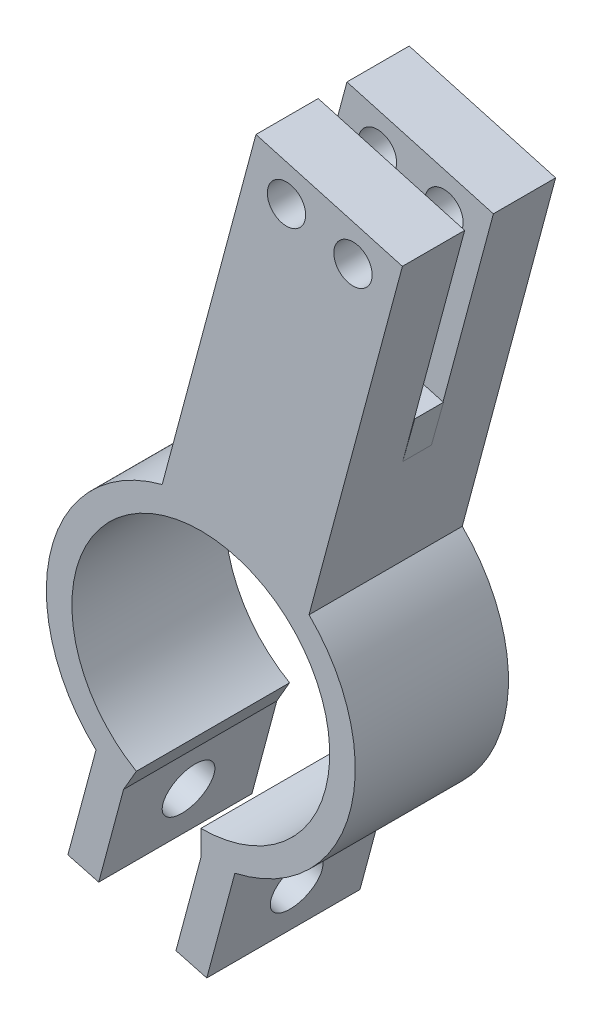
ISO-10303-21;
HEADER;
FILE_DESCRIPTION(('STEP AP214'),'2;1');
FILE_NAME('part.step','',(''),(''),'','','');
FILE_SCHEMA(('AUTOMOTIVE_DESIGN { 1 0 10303 214 1 1 1 1 }'));
ENDSEC;
DATA;
#1=APPLICATION_CONTEXT('core data for automotive mechanical design processes');
#2=APPLICATION_PROTOCOL_DEFINITION('international standard','automotive_design',2000,#1);
#3=PRODUCT_CONTEXT('',#1,'mechanical');
#4=PRODUCT('Part','Part','',(#3));
#5=PRODUCT_RELATED_PRODUCT_CATEGORY('part','',(#4));
#6=PRODUCT_DEFINITION_FORMATION('','',#4);
#7=PRODUCT_DEFINITION_CONTEXT('part definition',#1,'design');
#8=PRODUCT_DEFINITION('design','',#6,#7);
#9=PRODUCT_DEFINITION_SHAPE('','',#8);
#10=(LENGTH_UNIT() NAMED_UNIT(*) SI_UNIT(.MILLI.,.METRE.));
#11=(NAMED_UNIT(*) PLANE_ANGLE_UNIT() SI_UNIT($,.RADIAN.));
#12=(NAMED_UNIT(*) SI_UNIT($,.STERADIAN.) SOLID_ANGLE_UNIT());
#13=UNCERTAINTY_MEASURE_WITH_UNIT(LENGTH_MEASURE(1.E-05),#10,'distance_accuracy_value','');
#14=(GEOMETRIC_REPRESENTATION_CONTEXT(3) GLOBAL_UNCERTAINTY_ASSIGNED_CONTEXT((#13)) GLOBAL_UNIT_ASSIGNED_CONTEXT((#10,
#11,#12)) REPRESENTATION_CONTEXT('',''));
#15=CARTESIAN_POINT('',(0.,0.,0.));
#16=DIRECTION('',(0.,0.,1.));
#17=DIRECTION('',(1.,0.,0.));
#18=AXIS2_PLACEMENT_3D('',#15,#16,#17);
#19=CARTESIAN_POINT('',(-11.5029221421502,3.08219869858711,0.));
#20=DIRECTION('',(-0.965925826289068,0.25881904510252,0.));
#21=DIRECTION('',(-0.25881904510252,-0.965925826289069,0.));
#22=AXIS2_PLACEMENT_3D('',#19,#20,#21);
#23=PLANE('',#22);
#24=DIRECTION('',(-0.25881904510252,-0.965925826289069,0.));
#25=VECTOR('',#24,1.);
#26=CARTESIAN_POINT('',(-11.5029221421502,3.08219869858711,9.74999999999994));
#27=LINE('',#26,#25);
#28=CARTESIAN_POINT('',(-0.936311500436195,42.5173264772618,9.74999999999994));
#29=VERTEX_POINT('',#28);
#30=CARTESIAN_POINT('',(-1.19514591359743,41.5513432965967,9.74999999999994));
#31=VERTEX_POINT('',#30);
#32=EDGE_CURVE('E237',#29,#31,#27,.T.);
#33=ORIENTED_EDGE('',*,*,#32,.F.);
#34=DIRECTION('',(0.25881904510252,0.965925826289069,0.));
#35=VECTOR('',#34,1.);
#36=CARTESIAN_POINT('',(-11.5029221421502,3.08219869858711,9.74999999999994));
#37=LINE('',#36,#35);
#38=CARTESIAN_POINT('',(8.6405617865299,78.2587041618684,9.74999999999994));
#39=VERTEX_POINT('',#38);
#40=EDGE_CURVE('E268',#29,#39,#37,.T.);
#41=ORIENTED_EDGE('',*,*,#40,.T.);
#42=DIRECTION('',(0.,0.,1.));
#43=VECTOR('',#42,1.);
#44=CARTESIAN_POINT('',(8.64056178652989,78.2587041618684,-1.2490009027033E-13));
#45=LINE('',#44,#43);
#46=CARTESIAN_POINT('',(8.64056178652989,78.2587041618684,-1.2490009027033E-13));
#47=VERTEX_POINT('',#46);
#48=EDGE_CURVE('E308',#47,#39,#45,.T.);
#49=ORIENTED_EDGE('',*,*,#48,.F.);
#50=DIRECTION('',(-0.25881904510252,-0.965925826289069,0.));
#51=VECTOR('',#50,1.);
#52=CARTESIAN_POINT('',(-11.5029221421502,3.08219869858711,0.));
#53=LINE('',#52,#51);
#54=CARTESIAN_POINT('',(-6.05243588567322,23.4236903337157,-3.19189119579733E-13));
#55=VERTEX_POINT('',#54);
#56=EDGE_CURVE('E285',#47,#55,#53,.T.);
#57=ORIENTED_EDGE('',*,*,#56,.T.);
#58=DIRECTION('',(0.,0.,1.));
#59=VECTOR('',#58,1.);
#60=CARTESIAN_POINT('',(-6.05243588567322,23.4236903337157,-3.19189119579733E-13));
#61=LINE('',#60,#59);
#62=CARTESIAN_POINT('',(-6.05243588567299,23.4236903337159,24.));
#63=VERTEX_POINT('',#62);
#64=EDGE_CURVE('E305',#55,#63,#61,.T.);
#65=ORIENTED_EDGE('',*,*,#64,.T.);
#66=DIRECTION('',(-0.25881904510252,-0.965925826289069,0.));
#67=VECTOR('',#66,1.);
#68=CARTESIAN_POINT('',(-11.5029221421502,3.08219869858711,23.9999999999999));
#69=LINE('',#68,#67);
#70=CARTESIAN_POINT('',(8.64056178652989,78.2587041618684,23.9999999999999));
#71=VERTEX_POINT('',#70);
#72=EDGE_CURVE('E276',#71,#63,#69,.T.);
#73=ORIENTED_EDGE('',*,*,#72,.F.);
#74=CARTESIAN_POINT('',(8.64056178652989,78.2587041618684,14.2499999999999));
#75=VERTEX_POINT('',#74);
#76=EDGE_CURVE('E311',#75,#71,#45,.T.);
#77=ORIENTED_EDGE('',*,*,#76,.F.);
#78=DIRECTION('',(0.25881904510252,0.965925826289069,0.));
#79=VECTOR('',#78,1.);
#80=CARTESIAN_POINT('',(-11.5029221421502,3.08219869858711,14.2499999999999));
#81=LINE('',#80,#79);
#82=CARTESIAN_POINT('',(-0.936311500436195,42.5173264772618,14.2499999999999));
#83=VERTEX_POINT('',#82);
#84=EDGE_CURVE('E260',#83,#75,#81,.T.);
#85=ORIENTED_EDGE('',*,*,#84,.F.);
#86=DIRECTION('',(0.25881904510252,0.965925826289069,0.));
#87=VECTOR('',#86,1.);
#88=CARTESIAN_POINT('',(-11.5029221421502,3.08219869858711,14.2499999999999));
#89=LINE('',#88,#87);
#90=CARTESIAN_POINT('',(-1.19514591359743,41.5513432965967,14.2499999999999));
#91=VERTEX_POINT('',#90);
#92=EDGE_CURVE('E53',#91,#83,#89,.T.);
#93=ORIENTED_EDGE('',*,*,#92,.F.);
#94=DIRECTION('',(0.,0.,-1.));
#95=VECTOR('',#94,1.);
#96=CARTESIAN_POINT('',(-1.19514591359743,41.5513432965967,0.));
#97=LINE('',#96,#95);
#98=EDGE_CURVE('E11',#91,#31,#97,.T.);
#99=ORIENTED_EDGE('',*,*,#98,.T.);
#100=EDGE_LOOP('',(#33,#41,#49,#57,#65,#73,#77,#85,#93,#99));
#101=FACE_BOUND('',#100,.T.);
#102=ADVANCED_FACE('F35',(#101),#23,.T.);
#103=CARTESIAN_POINT('',(23.8358681079456,68.2980987617466,0.));
#104=DIRECTION('',(0.,0.,1.));
#105=DIRECTION('',(1.,0.,0.));
#106=AXIS2_PLACEMENT_3D('',#103,#104,#105);
#107=CYLINDRICAL_SURFACE('',#106,2.99999999999954);
#108=CARTESIAN_POINT('',(23.8358681079456,68.2980987617466,0.));
#109=DIRECTION('',(0.,0.,1.));
#110=DIRECTION('',(1.,0.,0.));
#111=AXIS2_PLACEMENT_3D('',#108,#109,#110);
#112=CIRCLE('',#111,2.99999999999954);
#113=CARTESIAN_POINT('',(26.8358681079451,68.2980987617466,0.));
#114=VERTEX_POINT('',#113);
#115=EDGE_CURVE('E275',#114,#114,#112,.T.);
#116=ORIENTED_EDGE('',*,*,#115,.F.);
#117=EDGE_LOOP('',(#116));
#118=FACE_BOUND('',#117,.T.);
#119=CARTESIAN_POINT('',(23.8358681079456,68.2980987617466,9.74999999999994));
#120=DIRECTION('',(0.,0.,1.));
#121=DIRECTION('',(1.,0.,0.));
#122=AXIS2_PLACEMENT_3D('',#119,#120,#121);
#123=CIRCLE('',#122,2.99999999999954);
#124=CARTESIAN_POINT('',(26.8358681079451,68.2980987617466,9.74999999999994));
#125=VERTEX_POINT('',#124);
#126=EDGE_CURVE('E265',#125,#125,#123,.F.);
#127=ORIENTED_EDGE('',*,*,#126,.F.);
#128=EDGE_LOOP('',(#127));
#129=FACE_BOUND('',#128,.T.);
#130=ADVANCED_FACE('F493',(#118,#129),#107,.F.);
#131=CARTESIAN_POINT('',(13.421299192768,71.2106731786557,-1.2490009027033E-13));
#132=DIRECTION('',(0.,0.,1.));
#133=DIRECTION('',(1.,0.,0.));
#134=AXIS2_PLACEMENT_3D('',#131,#132,#133);
#135=CYLINDRICAL_SURFACE('',#134,3.0000000000001);
#136=CARTESIAN_POINT('',(13.421299192768,71.2106731786557,-1.2490009027033E-13));
#137=DIRECTION('',(0.,0.,1.));
#138=DIRECTION('',(1.,0.,0.));
#139=AXIS2_PLACEMENT_3D('',#136,#137,#138);
#140=CIRCLE('',#139,3.0000000000001);
#141=CARTESIAN_POINT('',(16.4212991927682,71.2106731786557,-1.24882686260833E-13));
#142=VERTEX_POINT('',#141);
#143=EDGE_CURVE('E272',#142,#142,#140,.T.);
#144=ORIENTED_EDGE('',*,*,#143,.F.);
#145=EDGE_LOOP('',(#144));
#146=FACE_BOUND('',#145,.T.);
#147=CARTESIAN_POINT('',(13.421299192768,71.2106731786557,9.74999999999994));
#148=DIRECTION('',(0.,0.,1.));
#149=DIRECTION('',(1.,0.,0.));
#150=AXIS2_PLACEMENT_3D('',#147,#148,#149);
#151=CIRCLE('',#150,3.0000000000001);
#152=CARTESIAN_POINT('',(16.4212991927682,71.2106731786557,9.74999999999994));
#153=VERTEX_POINT('',#152);
#154=EDGE_CURVE('E262',#153,#153,#151,.F.);
#155=ORIENTED_EDGE('',*,*,#154,.F.);
#156=EDGE_LOOP('',(#155));
#157=FACE_BOUND('',#156,.T.);
#158=ADVANCED_FACE('F495',(#146,#157),#135,.F.);
#159=CARTESIAN_POINT('',(20.92529127906,74.8231141600154,0.));
#160=DIRECTION('',(0.269329374048198,0.963048123550846,0.));
#161=DIRECTION('',(-0.963048123550846,0.269329374048198,0.));
#162=AXIS2_PLACEMENT_3D('',#159,#160,#161);
#163=PLANE('',#162);
#164=ORIENTED_EDGE('',*,*,#48,.T.);
#165=DIRECTION('',(0.963048123550846,-0.269329374048198,0.));
#166=VECTOR('',#165,1.);
#167=CARTESIAN_POINT('',(20.9252912790602,74.8231141600154,9.74999999999994));
#168=LINE('',#167,#166);
#169=CARTESIAN_POINT('',(31.5792286287139,71.8435971375937,9.74999999999994));
#170=VERTEX_POINT('',#169);
#171=EDGE_CURVE('E251',#39,#170,#168,.T.);
#172=ORIENTED_EDGE('',*,*,#171,.T.);
#173=DIRECTION('',(0.,0.,1.));
#174=VECTOR('',#173,1.);
#175=CARTESIAN_POINT('',(31.5792286287138,71.8435971375937,0.));
#176=LINE('',#175,#174);
#177=CARTESIAN_POINT('',(31.5792286287138,71.8435971375937,0.));
#178=VERTEX_POINT('',#177);
#179=EDGE_CURVE('E312',#178,#170,#176,.T.);
#180=ORIENTED_EDGE('',*,*,#179,.F.);
#181=DIRECTION('',(-0.963048123550847,0.269329374048198,0.));
#182=VECTOR('',#181,1.);
#183=CARTESIAN_POINT('',(20.92529127906,74.8231141600154,0.));
#184=LINE('',#183,#182);
#185=EDGE_CURVE('E282',#178,#47,#184,.T.);
#186=ORIENTED_EDGE('',*,*,#185,.T.);
#187=EDGE_LOOP('',(#164,#172,#180,#186));
#188=FACE_BOUND('',#187,.T.);
#189=ADVANCED_FACE('F457',(#188),#163,.T.);
#190=CARTESIAN_POINT('',(0.,0.,24.));
#191=DIRECTION('',(0.,0.,-1.));
#192=DIRECTION('',(-1.,0.,0.));
#193=AXIS2_PLACEMENT_3D('',#190,#191,#192);
#194=CYLINDRICAL_SURFACE('',#193,24.193);
#195=CARTESIAN_POINT('',(0.,0.,0.));
#196=DIRECTION('',(0.,0.,1.));
#197=DIRECTION('',(1.,0.,0.));
#198=AXIS2_PLACEMENT_3D('',#195,#196,#197);
#199=CIRCLE('',#198,24.193);
#200=CARTESIAN_POINT('',(5.3360235923067,-23.5972053689064,0.));
#201=VERTEX_POINT('',#200);
#202=CARTESIAN_POINT('',(16.9534083986272,17.2592929365417,0.));
#203=VERTEX_POINT('',#202);
#204=EDGE_CURVE('E395',#201,#203,#199,.T.);
#205=ORIENTED_EDGE('',*,*,#204,.T.);
#206=DIRECTION('',(0.,0.,1.));
#207=VECTOR('',#206,1.);
#208=CARTESIAN_POINT('',(16.953408398627,17.2592929365415,0.));
#209=LINE('',#208,#207);
#210=CARTESIAN_POINT('',(16.9534083986272,17.2592929365417,24.));
#211=VERTEX_POINT('',#210);
#212=EDGE_CURVE('E302',#203,#211,#209,.T.);
#213=ORIENTED_EDGE('',*,*,#212,.T.);
#214=CARTESIAN_POINT('',(0.,0.,24.));
#215=DIRECTION('',(0.,0.,1.));
#216=DIRECTION('',(1.,0.,0.));
#217=AXIS2_PLACEMENT_3D('',#214,#215,#216);
#218=CIRCLE('',#217,24.193);
#219=CARTESIAN_POINT('',(5.3360235923067,-23.5972053689064,24.));
#220=VERTEX_POINT('',#219);
#221=EDGE_CURVE('E390',#220,#211,#218,.T.);
#222=ORIENTED_EDGE('',*,*,#221,.F.);
#223=DIRECTION('',(0.,0.,1.));
#224=VECTOR('',#223,1.);
#225=CARTESIAN_POINT('',(5.3360235923067,-23.5972053689064,0.));
#226=LINE('',#225,#224);
#227=EDGE_CURVE('E337',#201,#220,#226,.T.);
#228=ORIENTED_EDGE('',*,*,#227,.F.);
#229=EDGE_LOOP('',(#205,#213,#222,#228));
#230=FACE_BOUND('',#229,.T.);
#231=ADVANCED_FACE('F449',(#230),#194,.T.);
#232=CARTESIAN_POINT('',(-16.419734670584,-17.7677675116381,24.));
#233=VERTEX_POINT('',#232);
#234=EDGE_CURVE('E394',#63,#233,#218,.T.);
#235=ORIENTED_EDGE('',*,*,#234,.F.);
#236=ORIENTED_EDGE('',*,*,#64,.F.);
#237=CARTESIAN_POINT('',(-16.419734670584,-17.7677675116381,0.));
#238=VERTEX_POINT('',#237);
#239=EDGE_CURVE('E387',#55,#238,#199,.T.);
#240=ORIENTED_EDGE('',*,*,#239,.T.);
#241=DIRECTION('',(0.,0.,1.));
#242=VECTOR('',#241,1.);
#243=CARTESIAN_POINT('',(-16.419734670584,-17.7677675116381,0.));
#244=LINE('',#243,#242);
#245=EDGE_CURVE('E359',#238,#233,#244,.T.);
#246=ORIENTED_EDGE('',*,*,#245,.T.);
#247=EDGE_LOOP('',(#235,#236,#240,#246));
#248=FACE_BOUND('',#247,.T.);
#249=ADVANCED_FACE('F37',(#248),#194,.T.);
#250=CARTESIAN_POINT('',(0.,0.,24.));
#251=DIRECTION('',(0.,0.,1.));
#252=DIRECTION('',(1.,0.,0.));
#253=AXIS2_PLACEMENT_3D('',#250,#251,#252);
#254=PLANE('',#253);
#255=DIRECTION('',(-0.500000000000001,-0.866025403784438,0.));
#256=VECTOR('',#255,1.);
#257=CARTESIAN_POINT('',(-12.0965,-20.9517525937569,24.));
#258=LINE('',#257,#256);
#259=CARTESIAN_POINT('',(-10.0965,-17.4876509786192,24.));
#260=VERTEX_POINT('',#259);
#261=CARTESIAN_POINT('',(-12.0965,-20.9517525937569,24.));
#262=VERTEX_POINT('',#261);
#263=EDGE_CURVE('E372',#260,#262,#258,.T.);
#264=ORIENTED_EDGE('',*,*,#263,.F.);
#265=CARTESIAN_POINT('',(0.,0.,24.));
#266=DIRECTION('',(0.,0.,1.));
#267=DIRECTION('',(1.,0.,0.));
#268=AXIS2_PLACEMENT_3D('',#265,#266,#267);
#269=CIRCLE('',#268,20.193);
#270=CARTESIAN_POINT('',(0.,-20.193,24.));
#271=VERTEX_POINT('',#270);
#272=EDGE_CURVE('E384',#271,#260,#269,.T.);
#273=ORIENTED_EDGE('',*,*,#272,.F.);
#274=DIRECTION('',(0.,1.,0.));
#275=VECTOR('',#274,1.);
#276=CARTESIAN_POINT('',(0.,-24.193,24.));
#277=LINE('',#276,#275);
#278=CARTESIAN_POINT('',(0.,-24.193,24.));
#279=VERTEX_POINT('',#278);
#280=EDGE_CURVE('E362',#279,#271,#277,.T.);
#281=ORIENTED_EDGE('',*,*,#280,.F.);
#282=DIRECTION('',(0.258819045102521,0.965925826289068,0.));
#283=VECTOR('',#282,1.);
#284=CARTESIAN_POINT('',(6.04825000000001,-1.62062370312154,24.));
#285=LINE('',#284,#283);
#286=CARTESIAN_POINT('',(-3.89352930588146,-38.723849190308,24.));
#287=VERTEX_POINT('',#286);
#288=EDGE_CURVE('E324',#287,#279,#285,.T.);
#289=ORIENTED_EDGE('',*,*,#288,.F.);
#290=DIRECTION('',(-0.965925826289068,0.258819045102521,0.));
#291=VECTOR('',#290,1.);
#292=CARTESIAN_POINT('',(-9.94177930588146,-37.1032254871864,24.));
#293=LINE('',#292,#291);
#294=CARTESIAN_POINT('',(0.93609982556388,-40.0179444158206,24.));
#295=VERTEX_POINT('',#294);
#296=EDGE_CURVE('E334',#295,#287,#293,.T.);
#297=ORIENTED_EDGE('',*,*,#296,.F.);
#298=DIRECTION('',(-0.258819045102521,-0.965925826289068,0.));
#299=VECTOR('',#298,1.);
#300=CARTESIAN_POINT('',(10.8778791314454,-2.91471892863415,24.));
#301=LINE('',#300,#299);
#302=EDGE_CURVE('E328',#220,#295,#301,.T.);
#303=ORIENTED_EDGE('',*,*,#302,.F.);
#304=ORIENTED_EDGE('',*,*,#221,.T.);
#305=DIRECTION('',(0.258819045102521,0.965925826289069,0.));
#306=VECTOR('',#305,1.);
#307=CARTESIAN_POINT('',(11.50292214215,-3.08219869858731,24.));
#308=LINE('',#307,#306);
#309=CARTESIAN_POINT('',(31.5792286287138,71.8435971375937,24.));
#310=VERTEX_POINT('',#309);
#311=EDGE_CURVE('E294',#211,#310,#308,.T.);
#312=ORIENTED_EDGE('',*,*,#311,.T.);
#313=DIRECTION('',(-0.963048123550847,0.269329374048198,0.));
#314=VECTOR('',#313,1.);
#315=CARTESIAN_POINT('',(20.92529127906,74.8231141600154,24.));
#316=LINE('',#315,#314);
#317=EDGE_CURVE('E297',#310,#71,#316,.T.);
#318=ORIENTED_EDGE('',*,*,#317,.T.);
#319=ORIENTED_EDGE('',*,*,#72,.T.);
#320=ORIENTED_EDGE('',*,*,#234,.T.);
#321=DIRECTION('',(0.258819045102521,0.965925826289068,0.));
#322=VECTOR('',#321,1.);
#323=CARTESIAN_POINT('',(-10.8778791314454,2.91471892863415,24.));
#324=LINE('',#323,#322);
#325=CARTESIAN_POINT('',(-20.8196584373268,-34.1885065585523,24.));
#326=VERTEX_POINT('',#325);
#327=EDGE_CURVE('E339',#326,#233,#324,.T.);
#328=ORIENTED_EDGE('',*,*,#327,.F.);
#329=DIRECTION('',(-0.965925826289068,0.258819045102521,0.));
#330=VECTOR('',#329,1.);
#331=CARTESIAN_POINT('',(-9.94177930588146,-37.1032254871864,24.));
#332=LINE('',#331,#330);
#333=CARTESIAN_POINT('',(-15.9900293058815,-35.4826017840649,24.));
#334=VERTEX_POINT('',#333);
#335=EDGE_CURVE('E356',#334,#326,#332,.T.);
#336=ORIENTED_EDGE('',*,*,#335,.F.);
#337=DIRECTION('',(-0.258819045102521,-0.965925826289068,0.));
#338=VECTOR('',#337,1.);
#339=CARTESIAN_POINT('',(-6.04825000000001,1.62062370312154,24.));
#340=LINE('',#339,#338);
#341=EDGE_CURVE('E349',#262,#334,#340,.T.);
#342=ORIENTED_EDGE('',*,*,#341,.F.);
#343=EDGE_LOOP('',(#264,#273,#281,#289,#297,#303,#304,#312,#318,#319,#320,#328,#336,#342));
#344=FACE_BOUND('',#343,.T.);
#345=CARTESIAN_POINT('',(13.421299192768,71.2106731786557,23.9999999999999));
#346=DIRECTION('',(0.,0.,1.));
#347=DIRECTION('',(1.,0.,0.));
#348=AXIS2_PLACEMENT_3D('',#345,#346,#347);
#349=CIRCLE('',#348,3.0000000000001);
#350=CARTESIAN_POINT('',(16.4212991927682,71.2106731786557,23.9999999999999));
#351=VERTEX_POINT('',#350);
#352=EDGE_CURVE('E271',#351,#351,#349,.T.);
#353=ORIENTED_EDGE('',*,*,#352,.F.);
#354=EDGE_LOOP('',(#353));
#355=FACE_BOUND('',#354,.T.);
#356=CARTESIAN_POINT('',(23.8358681079456,68.2980987617466,24.));
#357=DIRECTION('',(0.,0.,1.));
#358=DIRECTION('',(1.,0.,0.));
#359=AXIS2_PLACEMENT_3D('',#356,#357,#358);
#360=CIRCLE('',#359,2.99999999999954);
#361=CARTESIAN_POINT('',(26.8358681079451,68.2980987617466,24.));
#362=VERTEX_POINT('',#361);
#363=EDGE_CURVE('E291',#362,#362,#360,.T.);
#364=ORIENTED_EDGE('',*,*,#363,.F.);
#365=EDGE_LOOP('',(#364));
#366=FACE_BOUND('',#365,.T.);
#367=ADVANCED_FACE('F430',(#344,#355,#366),#254,.T.);
#368=CARTESIAN_POINT('',(0.,0.,0.));
#369=DIRECTION('',(0.,0.,1.));
#370=DIRECTION('',(1.,0.,0.));
#371=AXIS2_PLACEMENT_3D('',#368,#369,#370);
#372=PLANE('',#371);
#373=CARTESIAN_POINT('',(0.,0.,0.));
#374=DIRECTION('',(0.,0.,1.));
#375=DIRECTION('',(1.,0.,0.));
#376=AXIS2_PLACEMENT_3D('',#373,#374,#375);
#377=CIRCLE('',#376,20.193);
#378=CARTESIAN_POINT('',(0.,-20.193,0.));
#379=VERTEX_POINT('',#378);
#380=CARTESIAN_POINT('',(-10.0965,-17.4876509786192,0.));
#381=VERTEX_POINT('',#380);
#382=EDGE_CURVE('E381',#379,#381,#377,.T.);
#383=ORIENTED_EDGE('',*,*,#382,.T.);
#384=DIRECTION('',(-0.500000000000001,-0.866025403784438,0.));
#385=VECTOR('',#384,1.);
#386=CARTESIAN_POINT('',(-12.0965,-20.9517525937569,0.));
#387=LINE('',#386,#385);
#388=CARTESIAN_POINT('',(-12.0965,-20.9517525937569,0.));
#389=VERTEX_POINT('',#388);
#390=EDGE_CURVE('E371',#381,#389,#387,.T.);
#391=ORIENTED_EDGE('',*,*,#390,.T.);
#392=DIRECTION('',(-0.258819045102521,-0.965925826289068,0.));
#393=VECTOR('',#392,1.);
#394=CARTESIAN_POINT('',(-6.04825000000001,1.62062370312154,0.));
#395=LINE('',#394,#393);
#396=CARTESIAN_POINT('',(-15.9900293058815,-35.4826017840649,0.));
#397=VERTEX_POINT('',#396);
#398=EDGE_CURVE('E351',#389,#397,#395,.T.);
#399=ORIENTED_EDGE('',*,*,#398,.T.);
#400=DIRECTION('',(-0.965925826289068,0.258819045102521,0.));
#401=VECTOR('',#400,1.);
#402=CARTESIAN_POINT('',(-9.94177930588146,-37.1032254871864,0.));
#403=LINE('',#402,#401);
#404=CARTESIAN_POINT('',(-20.8196584373268,-34.1885065585523,0.));
#405=VERTEX_POINT('',#404);
#406=EDGE_CURVE('E348',#397,#405,#403,.T.);
#407=ORIENTED_EDGE('',*,*,#406,.T.);
#408=DIRECTION('',(0.258819045102521,0.965925826289068,0.));
#409=VECTOR('',#408,1.);
#410=CARTESIAN_POINT('',(-10.8778791314454,2.91471892863415,0.));
#411=LINE('',#410,#409);
#412=EDGE_CURVE('E345',#405,#238,#411,.T.);
#413=ORIENTED_EDGE('',*,*,#412,.T.);
#414=ORIENTED_EDGE('',*,*,#239,.F.);
#415=ORIENTED_EDGE('',*,*,#56,.F.);
#416=ORIENTED_EDGE('',*,*,#185,.F.);
#417=DIRECTION('',(0.258819045102521,0.965925826289069,0.));
#418=VECTOR('',#417,1.);
#419=CARTESIAN_POINT('',(11.50292214215,-3.08219869858731,0.));
#420=LINE('',#419,#418);
#421=EDGE_CURVE('E279',#203,#178,#420,.T.);
#422=ORIENTED_EDGE('',*,*,#421,.F.);
#423=ORIENTED_EDGE('',*,*,#204,.F.);
#424=DIRECTION('',(-0.258819045102521,-0.965925826289068,0.));
#425=VECTOR('',#424,1.);
#426=CARTESIAN_POINT('',(10.8778791314454,-2.91471892863415,0.));
#427=LINE('',#426,#425);
#428=CARTESIAN_POINT('',(0.93609982556388,-40.0179444158206,0.));
#429=VERTEX_POINT('',#428);
#430=EDGE_CURVE('E330',#201,#429,#427,.T.);
#431=ORIENTED_EDGE('',*,*,#430,.T.);
#432=DIRECTION('',(-0.965925826289068,0.258819045102521,0.));
#433=VECTOR('',#432,1.);
#434=CARTESIAN_POINT('',(-9.94177930588146,-37.1032254871864,0.));
#435=LINE('',#434,#433);
#436=CARTESIAN_POINT('',(-3.89352930588146,-38.723849190308,0.));
#437=VERTEX_POINT('',#436);
#438=EDGE_CURVE('E327',#429,#437,#435,.T.);
#439=ORIENTED_EDGE('',*,*,#438,.T.);
#440=DIRECTION('',(0.258819045102521,0.965925826289068,0.));
#441=VECTOR('',#440,1.);
#442=CARTESIAN_POINT('',(6.04825000000001,-1.62062370312154,0.));
#443=LINE('',#442,#441);
#444=CARTESIAN_POINT('',(0.,-24.193,0.));
#445=VERTEX_POINT('',#444);
#446=EDGE_CURVE('E325',#437,#445,#443,.T.);
#447=ORIENTED_EDGE('',*,*,#446,.T.);
#448=DIRECTION('',(0.,1.,0.));
#449=VECTOR('',#448,1.);
#450=CARTESIAN_POINT('',(0.,-24.193,0.));
#451=LINE('',#450,#449);
#452=EDGE_CURVE('E368',#445,#379,#451,.T.);
#453=ORIENTED_EDGE('',*,*,#452,.T.);
#454=EDGE_LOOP('',(#383,#391,#399,#407,#413,#414,#415,#416,#422,#423,#431,#439,#447,#453));
#455=FACE_BOUND('',#454,.T.);
#456=ORIENTED_EDGE('',*,*,#143,.T.);
#457=EDGE_LOOP('',(#456));
#458=FACE_BOUND('',#457,.T.);
#459=ORIENTED_EDGE('',*,*,#115,.T.);
#460=EDGE_LOOP('',(#459));
#461=FACE_BOUND('',#460,.T.);
#462=ADVANCED_FACE('F438',(#455,#458,#461),#372,.F.);
#463=CARTESIAN_POINT('',(0.,0.,24.));
#464=DIRECTION('',(0.,0.,-1.));
#465=DIRECTION('',(-1.,0.,0.));
#466=AXIS2_PLACEMENT_3D('',#463,#464,#465);
#467=CYLINDRICAL_SURFACE('',#466,20.193);
#468=DIRECTION('',(0.,0.,-1.));
#469=VECTOR('',#468,1.);
#470=CARTESIAN_POINT('',(-10.0965,-17.4876509786192,24.));
#471=LINE('',#470,#469);
#472=EDGE_CURVE('E43',#381,#260,#471,.F.);
#473=ORIENTED_EDGE('',*,*,#472,.F.);
#474=ORIENTED_EDGE('',*,*,#382,.F.);
#475=DIRECTION('',(0.,0.,-1.));
#476=VECTOR('',#475,1.);
#477=CARTESIAN_POINT('',(0.,-20.193,24.));
#478=LINE('',#477,#476);
#479=EDGE_CURVE('E393',#271,#379,#478,.T.);
#480=ORIENTED_EDGE('',*,*,#479,.F.);
#481=ORIENTED_EDGE('',*,*,#272,.T.);
#482=EDGE_LOOP('',(#473,#474,#480,#481));
#483=FACE_BOUND('',#482,.T.);
#484=ADVANCED_FACE('F435',(#483),#467,.F.);
#485=CARTESIAN_POINT('',(0.,-24.193,0.));
#486=DIRECTION('',(1.,0.,0.));
#487=DIRECTION('',(0.,0.,-1.));
#488=AXIS2_PLACEMENT_3D('',#485,#486,#487);
#489=PLANE('',#488);
#490=ORIENTED_EDGE('',*,*,#479,.T.);
#491=ORIENTED_EDGE('',*,*,#452,.F.);
#492=DIRECTION('',(0.,0.,1.));
#493=VECTOR('',#492,1.);
#494=CARTESIAN_POINT('',(0.,-24.193,0.));
#495=LINE('',#494,#493);
#496=EDGE_CURVE('E375',#445,#279,#495,.T.);
#497=ORIENTED_EDGE('',*,*,#496,.T.);
#498=ORIENTED_EDGE('',*,*,#280,.T.);
#499=EDGE_LOOP('',(#490,#491,#497,#498));
#500=FACE_BOUND('',#499,.T.);
#501=ADVANCED_FACE('F426',(#500),#489,.F.);
#502=CARTESIAN_POINT('',(-12.0965,-20.9517525937569,0.));
#503=DIRECTION('',(-0.866025403784438,0.500000000000001,0.));
#504=DIRECTION('',(-0.500000000000001,-0.866025403784438,0.));
#505=AXIS2_PLACEMENT_3D('',#502,#503,#504);
#506=PLANE('',#505);
#507=ORIENTED_EDGE('',*,*,#472,.T.);
#508=ORIENTED_EDGE('',*,*,#263,.T.);
#509=DIRECTION('',(0.,0.,1.));
#510=VECTOR('',#509,1.);
#511=CARTESIAN_POINT('',(-12.0965,-20.9517525937569,0.));
#512=LINE('',#511,#510);
#513=EDGE_CURVE('E378',#389,#262,#512,.T.);
#514=ORIENTED_EDGE('',*,*,#513,.F.);
#515=ORIENTED_EDGE('',*,*,#390,.F.);
#516=EDGE_LOOP('',(#507,#508,#514,#515));
#517=FACE_BOUND('',#516,.T.);
#518=ADVANCED_FACE('F534',(#517),#506,.F.);
#519=CARTESIAN_POINT('',(-10.8778791314454,2.91471892863415,0.));
#520=DIRECTION('',(0.965925826289068,-0.258819045102521,0.));
#521=DIRECTION('',(0.258819045102521,0.965925826289068,0.));
#522=AXIS2_PLACEMENT_3D('',#519,#520,#521);
#523=PLANE('',#522);
#524=CARTESIAN_POINT('',(-18.7491060765067,-26.4610999482397,12.));
#525=DIRECTION('',(-0.965925826289068,0.258819045102521,0.));
#526=DIRECTION('',(-0.258819045102521,-0.965925826289068,0.));
#527=AXIS2_PLACEMENT_3D('',#524,#525,#526);
#528=CIRCLE('',#527,4.);
#529=CARTESIAN_POINT('',(-19.7843822569167,-30.324803253396,12.));
#530=VERTEX_POINT('',#529);
#531=EDGE_CURVE('E304',#530,#530,#528,.T.);
#532=ORIENTED_EDGE('',*,*,#531,.F.);
#533=EDGE_LOOP('',(#532));
#534=FACE_BOUND('',#533,.T.);
#535=ORIENTED_EDGE('',*,*,#327,.T.);
#536=ORIENTED_EDGE('',*,*,#245,.F.);
#537=ORIENTED_EDGE('',*,*,#412,.F.);
#538=DIRECTION('',(0.,0.,1.));
#539=VECTOR('',#538,1.);
#540=CARTESIAN_POINT('',(-20.8196584373268,-34.1885065585523,0.));
#541=LINE('',#540,#539);
#542=EDGE_CURVE('E353',#405,#326,#541,.T.);
#543=ORIENTED_EDGE('',*,*,#542,.T.);
#544=EDGE_LOOP('',(#535,#536,#537,#543));
#545=FACE_BOUND('',#544,.T.);
#546=ADVANCED_FACE('F537',(#534,#545),#523,.F.);
#547=CARTESIAN_POINT('',(-6.04825000000001,1.62062370312154,0.));
#548=DIRECTION('',(-0.965925826289068,0.258819045102521,0.));
#549=DIRECTION('',(-0.258819045102521,-0.965925826289068,0.));
#550=AXIS2_PLACEMENT_3D('',#547,#548,#549);
#551=PLANE('',#550);
#552=CARTESIAN_POINT('',(-13.9194769450613,-27.7551951737523,12.));
#553=DIRECTION('',(-0.965925826289068,0.258819045102521,0.));
#554=DIRECTION('',(-0.258819045102521,-0.965925826289068,0.));
#555=AXIS2_PLACEMENT_3D('',#552,#553,#554);
#556=CIRCLE('',#555,4.);
#557=CARTESIAN_POINT('',(-14.9547531254714,-31.6188984789086,12.));
#558=VERTEX_POINT('',#557);
#559=EDGE_CURVE('E321',#558,#558,#556,.T.);
#560=ORIENTED_EDGE('',*,*,#559,.T.);
#561=EDGE_LOOP('',(#560));
#562=FACE_BOUND('',#561,.T.);
#563=ORIENTED_EDGE('',*,*,#341,.T.);
#564=DIRECTION('',(0.,0.,1.));
#565=VECTOR('',#564,1.);
#566=CARTESIAN_POINT('',(-15.9900293058815,-35.4826017840649,0.));
#567=LINE('',#566,#565);
#568=EDGE_CURVE('E363',#397,#334,#567,.T.);
#569=ORIENTED_EDGE('',*,*,#568,.F.);
#570=ORIENTED_EDGE('',*,*,#398,.F.);
#571=ORIENTED_EDGE('',*,*,#513,.T.);
#572=EDGE_LOOP('',(#563,#569,#570,#571));
#573=FACE_BOUND('',#572,.T.);
#574=ADVANCED_FACE('F541',(#562,#573),#551,.F.);
#575=CARTESIAN_POINT('',(-9.94177930588146,-37.1032254871864,0.));
#576=DIRECTION('',(0.258819045102521,0.965925826289068,0.));
#577=DIRECTION('',(-0.965925826289068,0.258819045102521,0.));
#578=AXIS2_PLACEMENT_3D('',#575,#576,#577);
#579=PLANE('',#578);
#580=ORIENTED_EDGE('',*,*,#335,.T.);
#581=ORIENTED_EDGE('',*,*,#542,.F.);
#582=ORIENTED_EDGE('',*,*,#406,.F.);
#583=ORIENTED_EDGE('',*,*,#568,.T.);
#584=EDGE_LOOP('',(#580,#581,#582,#583));
#585=FACE_BOUND('',#584,.T.);
#586=ADVANCED_FACE('F415',(#585),#579,.F.);
#587=CARTESIAN_POINT('',(6.04825000000001,-1.62062370312154,0.));
#588=DIRECTION('',(0.965925826289068,-0.258819045102521,0.));
#589=DIRECTION('',(0.258819045102521,0.965925826289068,0.));
#590=AXIS2_PLACEMENT_3D('',#587,#588,#589);
#591=PLANE('',#590);
#592=CARTESIAN_POINT('',(-1.82297694506129,-30.9964425799954,12.));
#593=DIRECTION('',(0.965925826289068,-0.258819045102521,0.));
#594=DIRECTION('',(0.258819045102521,0.965925826289068,0.));
#595=AXIS2_PLACEMENT_3D('',#592,#593,#594);
#596=CIRCLE('',#595,4.);
#597=CARTESIAN_POINT('',(-0.78770076465121,-27.1327392748392,12.));
#598=VERTEX_POINT('',#597);
#599=EDGE_CURVE('E318',#598,#598,#596,.T.);
#600=ORIENTED_EDGE('',*,*,#599,.T.);
#601=EDGE_LOOP('',(#600));
#602=FACE_BOUND('',#601,.T.);
#603=ORIENTED_EDGE('',*,*,#288,.T.);
#604=ORIENTED_EDGE('',*,*,#496,.F.);
#605=ORIENTED_EDGE('',*,*,#446,.F.);
#606=DIRECTION('',(0.,0.,1.));
#607=VECTOR('',#606,1.);
#608=CARTESIAN_POINT('',(-3.89352930588146,-38.723849190308,0.));
#609=LINE('',#608,#607);
#610=EDGE_CURVE('E332',#437,#287,#609,.T.);
#611=ORIENTED_EDGE('',*,*,#610,.T.);
#612=EDGE_LOOP('',(#603,#604,#605,#611));
#613=FACE_BOUND('',#612,.T.);
#614=ADVANCED_FACE('F412',(#602,#613),#591,.F.);
#615=CARTESIAN_POINT('',(10.8778791314454,-2.91471892863415,0.));
#616=DIRECTION('',(-0.965925826289068,0.258819045102521,0.));
#617=DIRECTION('',(-0.258819045102521,-0.965925826289068,0.));
#618=AXIS2_PLACEMENT_3D('',#615,#616,#617);
#619=PLANE('',#618);
#620=CARTESIAN_POINT('',(3.00665218638405,-32.290537805508,12.));
#621=DIRECTION('',(-0.965925826289068,0.258819045102521,0.));
#622=DIRECTION('',(-0.258819045102521,-0.965925826289068,0.));
#623=AXIS2_PLACEMENT_3D('',#620,#621,#622);
#624=CIRCLE('',#623,4.);
#625=CARTESIAN_POINT('',(1.97137600597396,-36.1542411106643,12.));
#626=VERTEX_POINT('',#625);
#627=EDGE_CURVE('E317',#626,#626,#624,.T.);
#628=ORIENTED_EDGE('',*,*,#627,.T.);
#629=EDGE_LOOP('',(#628));
#630=FACE_BOUND('',#629,.T.);
#631=ORIENTED_EDGE('',*,*,#302,.T.);
#632=DIRECTION('',(0.,0.,1.));
#633=VECTOR('',#632,1.);
#634=CARTESIAN_POINT('',(0.93609982556388,-40.0179444158206,0.));
#635=LINE('',#634,#633);
#636=EDGE_CURVE('E340',#429,#295,#635,.T.);
#637=ORIENTED_EDGE('',*,*,#636,.F.);
#638=ORIENTED_EDGE('',*,*,#430,.F.);
#639=ORIENTED_EDGE('',*,*,#227,.T.);
#640=EDGE_LOOP('',(#631,#637,#638,#639));
#641=FACE_BOUND('',#640,.T.);
#642=ADVANCED_FACE('F401',(#630,#641),#619,.F.);
#643=CARTESIAN_POINT('',(-9.94177930588146,-37.1032254871864,0.));
#644=DIRECTION('',(0.258819045102521,0.965925826289068,0.));
#645=DIRECTION('',(-0.965925826289068,0.258819045102521,0.));
#646=AXIS2_PLACEMENT_3D('',#643,#644,#645);
#647=PLANE('',#646);
#648=ORIENTED_EDGE('',*,*,#296,.T.);
#649=ORIENTED_EDGE('',*,*,#610,.F.);
#650=ORIENTED_EDGE('',*,*,#438,.F.);
#651=ORIENTED_EDGE('',*,*,#636,.T.);
#652=EDGE_LOOP('',(#648,#649,#650,#651));
#653=FACE_BOUND('',#652,.T.);
#654=ADVANCED_FACE('F408',(#653),#647,.F.);
#655=CARTESIAN_POINT('',(4.43311375443099,-32.6727570307003,12.));
#656=DIRECTION('',(-0.965925826289068,0.258819045102521,0.));
#657=DIRECTION('',(-0.258819045102521,-0.965925826289068,0.));
#658=AXIS2_PLACEMENT_3D('',#655,#656,#657);
#659=CYLINDRICAL_SURFACE('',#658,4.);
#660=ORIENTED_EDGE('',*,*,#627,.F.);
#661=EDGE_LOOP('',(#660));
#662=FACE_BOUND('',#661,.T.);
#663=ORIENTED_EDGE('',*,*,#599,.F.);
#664=EDGE_LOOP('',(#663));
#665=FACE_BOUND('',#664,.T.);
#666=ADVANCED_FACE('F404',(#662,#665),#659,.F.);
#667=ORIENTED_EDGE('',*,*,#531,.T.);
#668=EDGE_LOOP('',(#667));
#669=FACE_BOUND('',#668,.T.);
#670=ORIENTED_EDGE('',*,*,#559,.F.);
#671=EDGE_LOOP('',(#670));
#672=FACE_BOUND('',#671,.T.);
#673=ADVANCED_FACE('F407',(#669,#672),#659,.F.);
#674=CARTESIAN_POINT('',(11.50292214215,-3.08219869858731,0.));
#675=DIRECTION('',(0.965925826289068,-0.258819045102521,0.));
#676=DIRECTION('',(0.258819045102521,0.965925826289068,0.));
#677=AXIS2_PLACEMENT_3D('',#674,#675,#676);
#678=PLANE('',#677);
#679=DIRECTION('',(-0.258819045102521,-0.965925826289068,0.));
#680=VECTOR('',#679,1.);
#681=CARTESIAN_POINT('',(31.5792286287139,71.8435971375937,14.2499999999999));
#682=LINE('',#681,#680);
#683=CARTESIAN_POINT('',(31.5792286287139,71.8435971375937,14.2499999999999));
#684=VERTEX_POINT('',#683);
#685=CARTESIAN_POINT('',(23.6847790272959,42.3811101273099,14.2499999999999));
#686=VERTEX_POINT('',#685);
#687=EDGE_CURVE('E239',#684,#686,#682,.T.);
#688=ORIENTED_EDGE('',*,*,#687,.F.);
#689=EDGE_CURVE('E288',#684,#310,#176,.T.);
#690=ORIENTED_EDGE('',*,*,#689,.T.);
#691=ORIENTED_EDGE('',*,*,#311,.F.);
#692=ORIENTED_EDGE('',*,*,#212,.F.);
#693=ORIENTED_EDGE('',*,*,#421,.T.);
#694=ORIENTED_EDGE('',*,*,#179,.T.);
#695=DIRECTION('',(0.258819045102521,0.965925826289068,0.));
#696=VECTOR('',#695,1.);
#697=CARTESIAN_POINT('',(31.5792286287139,71.8435971375937,9.74999999999994));
#698=LINE('',#697,#696);
#699=CARTESIAN_POINT('',(23.6847790272959,42.3811101273099,9.74999999999994));
#700=VERTEX_POINT('',#699);
#701=EDGE_CURVE('E244',#700,#170,#698,.T.);
#702=ORIENTED_EDGE('',*,*,#701,.F.);
#703=CARTESIAN_POINT('',(21.8735144373693,35.6213786517537,9.74999999999994));
#704=VERTEX_POINT('',#703);
#705=EDGE_CURVE('E245',#704,#700,#698,.T.);
#706=ORIENTED_EDGE('',*,*,#705,.F.);
#707=DIRECTION('',(0.,0.,-1.));
#708=VECTOR('',#707,1.);
#709=CARTESIAN_POINT('',(21.8735144373694,35.6213786517537,14.2499999999999));
#710=LINE('',#709,#708);
#711=CARTESIAN_POINT('',(21.8735144373694,35.6213786517537,14.2499999999999));
#712=VERTEX_POINT('',#711);
#713=EDGE_CURVE('E242',#712,#704,#710,.T.);
#714=ORIENTED_EDGE('',*,*,#713,.F.);
#715=DIRECTION('',(-0.258819045102521,-0.965925826289068,0.));
#716=VECTOR('',#715,1.);
#717=CARTESIAN_POINT('',(11.50292214215,-3.08219869858731,14.2499999999999));
#718=LINE('',#717,#716);
#719=EDGE_CURVE('E204',#686,#712,#718,.T.);
#720=ORIENTED_EDGE('',*,*,#719,.F.);
#721=EDGE_LOOP('',(#688,#690,#691,#692,#693,#694,#702,#706,#714,#720));
#722=FACE_BOUND('',#721,.T.);
#723=ADVANCED_FACE('F453',(#722),#678,.T.);
#724=CARTESIAN_POINT('',(23.8358681079456,68.2980987617466,14.2499999999999));
#725=DIRECTION('',(0.,0.,1.));
#726=DIRECTION('',(1.,0.,0.));
#727=AXIS2_PLACEMENT_3D('',#724,#725,#726);
#728=CIRCLE('',#727,2.99999999999954);
#729=CARTESIAN_POINT('',(26.8358681079451,68.2980987617466,14.2499999999999));
#730=VERTEX_POINT('',#729);
#731=EDGE_CURVE('E257',#730,#730,#728,.F.);
#732=ORIENTED_EDGE('',*,*,#731,.T.);
#733=EDGE_LOOP('',(#732));
#734=FACE_BOUND('',#733,.T.);
#735=ORIENTED_EDGE('',*,*,#363,.T.);
#736=EDGE_LOOP('',(#735));
#737=FACE_BOUND('',#736,.T.);
#738=ADVANCED_FACE('F498',(#734,#737),#107,.F.);
#739=CARTESIAN_POINT('',(13.421299192768,71.2106731786557,14.2499999999999));
#740=DIRECTION('',(0.,0.,1.));
#741=DIRECTION('',(1.,0.,0.));
#742=AXIS2_PLACEMENT_3D('',#739,#740,#741);
#743=CIRCLE('',#742,3.0000000000001);
#744=CARTESIAN_POINT('',(16.4212991927682,71.2106731786557,14.2499999999999));
#745=VERTEX_POINT('',#744);
#746=EDGE_CURVE('E254',#745,#745,#743,.F.);
#747=ORIENTED_EDGE('',*,*,#746,.T.);
#748=EDGE_LOOP('',(#747));
#749=FACE_BOUND('',#748,.T.);
#750=ORIENTED_EDGE('',*,*,#352,.T.);
#751=EDGE_LOOP('',(#750));
#752=FACE_BOUND('',#751,.T.);
#753=ADVANCED_FACE('F505',(#749,#752),#135,.F.);
#754=DIRECTION('',(0.963048123550846,-0.269329374048198,0.));
#755=VECTOR('',#754,1.);
#756=CARTESIAN_POINT('',(20.9252912790602,74.8231141600154,14.2499999999999));
#757=LINE('',#756,#755);
#758=EDGE_CURVE('E248',#75,#684,#757,.T.);
#759=ORIENTED_EDGE('',*,*,#758,.F.);
#760=ORIENTED_EDGE('',*,*,#76,.T.);
#761=ORIENTED_EDGE('',*,*,#317,.F.);
#762=ORIENTED_EDGE('',*,*,#689,.F.);
#763=EDGE_LOOP('',(#759,#760,#761,#762));
#764=FACE_BOUND('',#763,.T.);
#765=ADVANCED_FACE('F487',(#764),#163,.T.);
#766=CARTESIAN_POINT('',(10.9601044392769,39.190333588634,9.74999999999994));
#767=DIRECTION('',(0.,0.,1.));
#768=DIRECTION('',(1.,0.,0.));
#769=AXIS2_PLACEMENT_3D('',#766,#767,#768);
#770=PLANE('',#769);
#771=DIRECTION('',(0.269329374048198,0.963048123550846,0.));
#772=VECTOR('',#771,1.);
#773=CARTESIAN_POINT('',(-1.20564087448439,41.5542783537109,9.74999999999994));
#774=LINE('',#773,#772);
#775=CARTESIAN_POINT('',(0.814329430877097,48.7771392803423,9.74999999999994));
#776=VERTEX_POINT('',#775);
#777=EDGE_CURVE('E231',#29,#776,#774,.T.);
#778=ORIENTED_EDGE('',*,*,#777,.T.);
#779=DIRECTION('',(-0.963048123550846,0.269329374048198,0.));
#780=VECTOR('',#779,1.);
#781=CARTESIAN_POINT('',(0.814329430877096,48.7771392803423,9.74999999999994));
#782=LINE('',#781,#780);
#783=EDGE_CURVE('E212',#700,#776,#782,.T.);
#784=ORIENTED_EDGE('',*,*,#783,.F.);
#785=ORIENTED_EDGE('',*,*,#701,.T.);
#786=ORIENTED_EDGE('',*,*,#171,.F.);
#787=ORIENTED_EDGE('',*,*,#40,.F.);
#788=EDGE_LOOP('',(#778,#784,#785,#786,#787));
#789=FACE_BOUND('',#788,.T.);
#790=ORIENTED_EDGE('',*,*,#154,.T.);
#791=EDGE_LOOP('',(#790));
#792=FACE_BOUND('',#791,.T.);
#793=ORIENTED_EDGE('',*,*,#126,.T.);
#794=EDGE_LOOP('',(#793));
#795=FACE_BOUND('',#794,.T.);
#796=ADVANCED_FACE('F484',(#789,#792,#795),#770,.T.);
#797=CARTESIAN_POINT('',(10.9601044392769,39.190333588634,14.2499999999999));
#798=DIRECTION('',(0.,0.,1.));
#799=DIRECTION('',(1.,0.,0.));
#800=AXIS2_PLACEMENT_3D('',#797,#798,#799);
#801=PLANE('',#800);
#802=DIRECTION('',(0.963048123550846,-0.269329374048198,0.));
#803=VECTOR('',#802,1.);
#804=CARTESIAN_POINT('',(0.814329430877096,48.7771392803423,14.2499999999999));
#805=LINE('',#804,#803);
#806=CARTESIAN_POINT('',(0.814329430877097,48.7771392803423,14.2499999999999));
#807=VERTEX_POINT('',#806);
#808=EDGE_CURVE('E196',#807,#686,#805,.T.);
#809=ORIENTED_EDGE('',*,*,#808,.F.);
#810=DIRECTION('',(0.269329374048198,0.963048123550846,0.));
#811=VECTOR('',#810,1.);
#812=CARTESIAN_POINT('',(-1.20564087448439,41.5542783537109,14.2499999999999));
#813=LINE('',#812,#811);
#814=EDGE_CURVE('E227',#83,#807,#813,.T.);
#815=ORIENTED_EDGE('',*,*,#814,.F.);
#816=ORIENTED_EDGE('',*,*,#84,.T.);
#817=ORIENTED_EDGE('',*,*,#758,.T.);
#818=ORIENTED_EDGE('',*,*,#687,.T.);
#819=EDGE_LOOP('',(#809,#815,#816,#817,#818));
#820=FACE_BOUND('',#819,.T.);
#821=ORIENTED_EDGE('',*,*,#746,.F.);
#822=EDGE_LOOP('',(#821));
#823=FACE_BOUND('',#822,.T.);
#824=ORIENTED_EDGE('',*,*,#731,.F.);
#825=EDGE_LOOP('',(#824));
#826=FACE_BOUND('',#825,.T.);
#827=ADVANCED_FACE('F469',(#820,#823,#826),#801,.F.);
#828=CARTESIAN_POINT('',(-1.20564087448439,41.5542783537109,9.74999999999994));
#829=DIRECTION('',(-0.963048123550846,0.269329374048198,0.));
#830=DIRECTION('',(-0.269329374048198,-0.963048123550846,0.));
#831=AXIS2_PLACEMENT_3D('',#828,#829,#830);
#832=PLANE('',#831);
#833=ORIENTED_EDGE('',*,*,#777,.F.);
#834=CARTESIAN_POINT('',(-1.20564087448439,41.5542783537109,9.74999999999994));
#835=VERTEX_POINT('',#834);
#836=EDGE_CURVE('E228',#835,#29,#774,.T.);
#837=ORIENTED_EDGE('',*,*,#836,.F.);
#838=DIRECTION('',(0.,0.,1.));
#839=VECTOR('',#838,1.);
#840=CARTESIAN_POINT('',(-1.20564087448439,41.5542783537109,9.74999999999994));
#841=LINE('',#840,#839);
#842=CARTESIAN_POINT('',(-1.20564087448439,41.5542783537109,14.2499999999999));
#843=VERTEX_POINT('',#842);
#844=EDGE_CURVE('E219',#835,#843,#841,.T.);
#845=ORIENTED_EDGE('',*,*,#844,.T.);
#846=EDGE_CURVE('E208',#843,#83,#813,.T.);
#847=ORIENTED_EDGE('',*,*,#846,.T.);
#848=ORIENTED_EDGE('',*,*,#814,.T.);
#849=DIRECTION('',(0.,0.,1.));
#850=VECTOR('',#849,1.);
#851=CARTESIAN_POINT('',(0.814329430877096,48.7771392803423,9.74999999999994));
#852=LINE('',#851,#850);
#853=EDGE_CURVE('E199',#776,#807,#852,.T.);
#854=ORIENTED_EDGE('',*,*,#853,.F.);
#855=EDGE_LOOP('',(#833,#837,#845,#847,#848,#854));
#856=FACE_BOUND('',#855,.T.);
#857=ADVANCED_FACE('F466',(#856),#832,.T.);
#858=CARTESIAN_POINT('',(21.7382500808134,35.1377103358675,9.74999999999994));
#859=DIRECTION('',(0.963048123550846,-0.269329374048198,0.));
#860=DIRECTION('',(0.269329374048198,0.963048123550846,0.));
#861=AXIS2_PLACEMENT_3D('',#858,#859,#860);
#862=PLANE('',#861);
#863=ORIENTED_EDGE('',*,*,#713,.T.);
#864=DIRECTION('',(0.269329374048198,0.963048123550846,0.));
#865=VECTOR('',#864,1.);
#866=CARTESIAN_POINT('',(21.7382500808134,35.1377103358675,9.74999999999994));
#867=LINE('',#866,#865);
#868=CARTESIAN_POINT('',(23.7582203861748,42.3605712624989,9.74999999999994));
#869=VERTEX_POINT('',#868);
#870=EDGE_CURVE('E207',#704,#869,#867,.T.);
#871=ORIENTED_EDGE('',*,*,#870,.T.);
#872=DIRECTION('',(0.,0.,-1.));
#873=VECTOR('',#872,1.);
#874=CARTESIAN_POINT('',(23.7582203861748,42.3605712624989,9.74999999999994));
#875=LINE('',#874,#873);
#876=CARTESIAN_POINT('',(23.7582203861748,42.3605712624989,14.2499999999999));
#877=VERTEX_POINT('',#876);
#878=EDGE_CURVE('E194',#877,#869,#875,.T.);
#879=ORIENTED_EDGE('',*,*,#878,.F.);
#880=DIRECTION('',(0.269329374048198,0.963048123550846,0.));
#881=VECTOR('',#880,1.);
#882=CARTESIAN_POINT('',(21.7382500808134,35.1377103358675,14.2499999999999));
#883=LINE('',#882,#881);
#884=EDGE_CURVE('E202',#712,#877,#883,.T.);
#885=ORIENTED_EDGE('',*,*,#884,.F.);
#886=EDGE_LOOP('',(#863,#871,#879,#885));
#887=FACE_BOUND('',#886,.T.);
#888=ADVANCED_FACE('F210',(#887),#862,.T.);
#889=CARTESIAN_POINT('',(-1.20564087448439,41.5542783537109,9.74999999999994));
#890=DIRECTION('',(0.,0.,-1.));
#891=DIRECTION('',(0.,1.,0.));
#892=AXIS2_PLACEMENT_3D('',#889,#890,#891);
#893=PLANE('',#892);
#894=ORIENTED_EDGE('',*,*,#836,.T.);
#895=ORIENTED_EDGE('',*,*,#32,.T.);
#896=DIRECTION('',(-0.963048123550846,0.269329374048198,0.));
#897=VECTOR('',#896,1.);
#898=CARTESIAN_POINT('',(-1.20564087448439,41.5542783537109,9.74999999999994));
#899=LINE('',#898,#897);
#900=EDGE_CURVE('E225',#31,#835,#899,.T.);
#901=ORIENTED_EDGE('',*,*,#900,.T.);
#902=EDGE_LOOP('',(#894,#895,#901));
#903=FACE_BOUND('',#902,.T.);
#904=ADVANCED_FACE('F482',(#903),#893,.T.);
#905=CARTESIAN_POINT('',(-1.20564087448439,41.5542783537109,14.2499999999999));
#906=DIRECTION('',(0.,0.,1.));
#907=DIRECTION('',(0.,-1.,0.));
#908=AXIS2_PLACEMENT_3D('',#905,#906,#907);
#909=PLANE('',#908);
#910=DIRECTION('',(0.963048123550846,-0.269329374048198,0.));
#911=VECTOR('',#910,1.);
#912=CARTESIAN_POINT('',(-1.20564087448439,41.5542783537109,14.2499999999999));
#913=LINE('',#912,#911);
#914=EDGE_CURVE('E222',#843,#91,#913,.T.);
#915=ORIENTED_EDGE('',*,*,#914,.T.);
#916=ORIENTED_EDGE('',*,*,#92,.T.);
#917=ORIENTED_EDGE('',*,*,#846,.F.);
#918=EDGE_LOOP('',(#915,#916,#917));
#919=FACE_BOUND('',#918,.T.);
#920=ADVANCED_FACE('F475',(#919),#909,.T.);
#921=ORIENTED_EDGE('',*,*,#870,.F.);
#922=ORIENTED_EDGE('',*,*,#705,.T.);
#923=EDGE_CURVE('E215',#869,#700,#782,.T.);
#924=ORIENTED_EDGE('',*,*,#923,.F.);
#925=EDGE_LOOP('',(#921,#922,#924));
#926=FACE_BOUND('',#925,.T.);
#927=ADVANCED_FACE('F461',(#926),#893,.T.);
#928=EDGE_CURVE('E188',#686,#877,#805,.T.);
#929=ORIENTED_EDGE('',*,*,#928,.F.);
#930=ORIENTED_EDGE('',*,*,#719,.T.);
#931=ORIENTED_EDGE('',*,*,#884,.T.);
#932=EDGE_LOOP('',(#929,#930,#931));
#933=FACE_BOUND('',#932,.T.);
#934=ADVANCED_FACE('F203',(#933),#909,.T.);
#935=CARTESIAN_POINT('',(10.6907750652287,38.2272854650832,0.));
#936=DIRECTION('',(0.269329374048198,0.963048123550846,0.));
#937=DIRECTION('',(-0.963048123550846,0.269329374048198,0.));
#938=AXIS2_PLACEMENT_3D('',#935,#936,#937);
#939=PLANE('',#938);
#940=ORIENTED_EDGE('',*,*,#98,.F.);
#941=ORIENTED_EDGE('',*,*,#914,.F.);
#942=ORIENTED_EDGE('',*,*,#844,.F.);
#943=ORIENTED_EDGE('',*,*,#900,.F.);
#944=EDGE_LOOP('',(#940,#941,#942,#943));
#945=FACE_BOUND('',#944,.T.);
#946=ADVANCED_FACE('F479',(#945),#939,.F.);
#947=CARTESIAN_POINT('',(12.7107453705902,45.4501463917146,0.));
#948=DIRECTION('',(0.269329374048198,0.963048123550846,0.));
#949=DIRECTION('',(-0.963048123550846,0.269329374048198,0.));
#950=AXIS2_PLACEMENT_3D('',#947,#948,#949);
#951=PLANE('',#950);
#952=ORIENTED_EDGE('',*,*,#853,.T.);
#953=ORIENTED_EDGE('',*,*,#808,.T.);
#954=ORIENTED_EDGE('',*,*,#928,.T.);
#955=ORIENTED_EDGE('',*,*,#878,.T.);
#956=ORIENTED_EDGE('',*,*,#923,.T.);
#957=ORIENTED_EDGE('',*,*,#783,.T.);
#958=EDGE_LOOP('',(#952,#953,#954,#955,#956,#957));
#959=FACE_BOUND('',#958,.T.);
#960=ADVANCED_FACE('F191',(#959),#951,.T.);
#961=CLOSED_SHELL('',(#102,#130,#158,#189,#231,#249,#367,#462,#484,#501,#518,#546,#574,#586,
#614,#642,#654,#666,#673,#723,#738,#753,#765,#796,#827,#857,#888,#904,#920,#927,#934,#946,#960));
#962=MANIFOLD_SOLID_BREP('B2',#961);
#963=ADVANCED_BREP_SHAPE_REPRESENTATION('',(#18,#962),#14);
#964=SHAPE_DEFINITION_REPRESENTATION(#9,#963);
ENDSEC;
END-ISO-10303-21;
